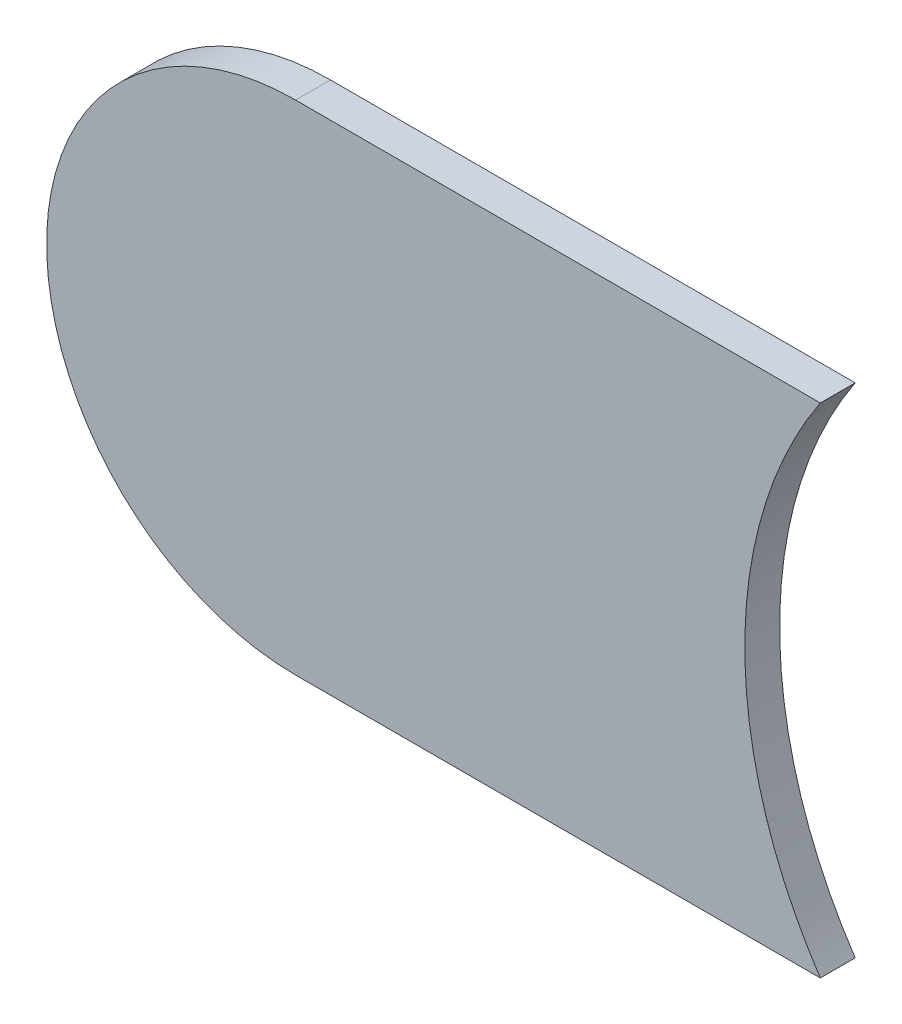
ISO-10303-21;
HEADER;
FILE_DESCRIPTION(('STEP AP214'),'2;1');
FILE_NAME('part.step','',(''),(''),'','','');
FILE_SCHEMA(('AUTOMOTIVE_DESIGN { 1 0 10303 214 1 1 1 1 }'));
ENDSEC;
DATA;
#1=APPLICATION_CONTEXT('core data for automotive mechanical design processes');
#2=APPLICATION_PROTOCOL_DEFINITION('international standard','automotive_design',2000,#1);
#3=PRODUCT_CONTEXT('',#1,'mechanical');
#4=PRODUCT('Part','Part','',(#3));
#5=PRODUCT_RELATED_PRODUCT_CATEGORY('part','',(#4));
#6=PRODUCT_DEFINITION_FORMATION('','',#4);
#7=PRODUCT_DEFINITION_CONTEXT('part definition',#1,'design');
#8=PRODUCT_DEFINITION('design','',#6,#7);
#9=PRODUCT_DEFINITION_SHAPE('','',#8);
#10=(LENGTH_UNIT() NAMED_UNIT(*) SI_UNIT(.MILLI.,.METRE.));
#11=(NAMED_UNIT(*) PLANE_ANGLE_UNIT() SI_UNIT($,.RADIAN.));
#12=(NAMED_UNIT(*) SI_UNIT($,.STERADIAN.) SOLID_ANGLE_UNIT());
#13=UNCERTAINTY_MEASURE_WITH_UNIT(LENGTH_MEASURE(1.E-05),#10,'distance_accuracy_value','');
#14=(GEOMETRIC_REPRESENTATION_CONTEXT(3) GLOBAL_UNCERTAINTY_ASSIGNED_CONTEXT((#13)) GLOBAL_UNIT_ASSIGNED_CONTEXT((#10,
#11,#12)) REPRESENTATION_CONTEXT('',''));
#15=CARTESIAN_POINT('',(0.,0.,0.));
#16=DIRECTION('',(0.,0.,1.));
#17=DIRECTION('',(1.,0.,0.));
#18=AXIS2_PLACEMENT_3D('',#15,#16,#17);
#19=CARTESIAN_POINT('',(177.26,-126.706,-0.035));
#20=DIRECTION('',(0.,-1.,0.));
#21=DIRECTION('',(0.,0.,-1.));
#22=AXIS2_PLACEMENT_3D('',#19,#20,#21);
#23=PLANE('',#22);
#24=DIRECTION('',(0.,0.,1.));
#25=VECTOR('',#24,1.);
#26=CARTESIAN_POINT('',(176.359,-126.706,-0.035));
#27=LINE('',#26,#25);
#28=CARTESIAN_POINT('',(176.359,-126.706,-0.035));
#29=VERTEX_POINT('',#28);
#30=CARTESIAN_POINT('',(176.359,-126.706,0.));
#31=VERTEX_POINT('',#30);
#32=EDGE_CURVE('E11',#29,#31,#27,.T.);
#33=ORIENTED_EDGE('',*,*,#32,.T.);
#34=DIRECTION('',(-1.,0.,0.));
#35=VECTOR('',#34,1.);
#36=CARTESIAN_POINT('',(177.26,-126.706,0.));
#37=LINE('',#36,#35);
#38=CARTESIAN_POINT('',(176.88583426132,-126.706,0.));
#39=VERTEX_POINT('',#38);
#40=EDGE_CURVE('E20',#39,#31,#37,.T.);
#41=ORIENTED_EDGE('',*,*,#40,.F.);
#42=DIRECTION('',(0.,0.,-1.));
#43=VECTOR('',#42,1.);
#44=CARTESIAN_POINT('',(176.88583426132,-126.706,-0.045));
#45=LINE('',#44,#43);
#46=CARTESIAN_POINT('',(176.88583426132,-126.706,-0.035));
#47=VERTEX_POINT('',#46);
#48=EDGE_CURVE('E74',#39,#47,#45,.T.);
#49=ORIENTED_EDGE('',*,*,#48,.T.);
#50=DIRECTION('',(-1.,0.,0.));
#51=VECTOR('',#50,1.);
#52=CARTESIAN_POINT('',(177.26,-126.706,-0.035));
#53=LINE('',#52,#51);
#54=EDGE_CURVE('E104',#47,#29,#53,.T.);
#55=ORIENTED_EDGE('',*,*,#54,.T.);
#56=EDGE_LOOP('',(#33,#41,#49,#55));
#57=FACE_BOUND('',#56,.T.);
#58=ADVANCED_FACE('F17',(#57),#23,.F.);
#59=CARTESIAN_POINT('',(176.359,-126.956,-0.035));
#60=DIRECTION('',(0.,0.,-1.));
#61=DIRECTION('',(0.,1.,0.));
#62=AXIS2_PLACEMENT_3D('',#59,#60,#61);
#63=CYLINDRICAL_SURFACE('',#62,0.25);
#64=CARTESIAN_POINT('',(176.359,-126.956,-0.035));
#65=DIRECTION('',(0.,0.,1.));
#66=DIRECTION('',(0.,1.,0.));
#67=AXIS2_PLACEMENT_3D('',#64,#65,#66);
#68=CIRCLE('',#67,0.25);
#69=CARTESIAN_POINT('',(176.359,-127.206,-0.035));
#70=VERTEX_POINT('',#69);
#71=EDGE_CURVE('E77',#29,#70,#68,.T.);
#72=ORIENTED_EDGE('',*,*,#71,.T.);
#73=DIRECTION('',(0.,0.,1.));
#74=VECTOR('',#73,1.);
#75=CARTESIAN_POINT('',(176.359,-127.206,-0.035));
#76=LINE('',#75,#74);
#77=CARTESIAN_POINT('',(176.359,-127.206,0.));
#78=VERTEX_POINT('',#77);
#79=EDGE_CURVE('E88',#70,#78,#76,.T.);
#80=ORIENTED_EDGE('',*,*,#79,.T.);
#81=CARTESIAN_POINT('',(176.359,-126.956,0.));
#82=DIRECTION('',(0.,0.,1.));
#83=DIRECTION('',(0.,1.,0.));
#84=AXIS2_PLACEMENT_3D('',#81,#82,#83);
#85=CIRCLE('',#84,0.25);
#86=EDGE_CURVE('E83',#31,#78,#85,.T.);
#87=ORIENTED_EDGE('',*,*,#86,.F.);
#88=ORIENTED_EDGE('',*,*,#32,.F.);
#89=EDGE_LOOP('',(#72,#80,#87,#88));
#90=FACE_BOUND('',#89,.T.);
#91=ADVANCED_FACE('F120',(#90),#63,.T.);
#92=CARTESIAN_POINT('',(176.359,-127.206,0.));
#93=DIRECTION('',(0.,0.,1.));
#94=DIRECTION('',(1.,0.,0.));
#95=AXIS2_PLACEMENT_3D('',#92,#93,#94);
#96=PLANE('',#95);
#97=ORIENTED_EDGE('',*,*,#86,.T.);
#98=DIRECTION('',(1.,0.,0.));
#99=VECTOR('',#98,1.);
#100=CARTESIAN_POINT('',(176.359,-127.206,0.));
#101=LINE('',#100,#99);
#102=CARTESIAN_POINT('',(176.88583426132,-127.206,0.));
#103=VERTEX_POINT('',#102);
#104=EDGE_CURVE('E80',#78,#103,#101,.T.);
#105=ORIENTED_EDGE('',*,*,#104,.T.);
#106=CARTESIAN_POINT('',(177.26,-126.956,0.));
#107=DIRECTION('',(0.,0.,-1.));
#108=DIRECTION('',(0.,-1.,0.));
#109=AXIS2_PLACEMENT_3D('',#106,#107,#108);
#110=CIRCLE('',#109,0.45);
#111=EDGE_CURVE('E68',#103,#39,#110,.T.);
#112=ORIENTED_EDGE('',*,*,#111,.T.);
#113=ORIENTED_EDGE('',*,*,#40,.T.);
#114=EDGE_LOOP('',(#97,#105,#112,#113));
#115=FACE_BOUND('',#114,.T.);
#116=ADVANCED_FACE('F81',(#115),#96,.T.);
#117=CARTESIAN_POINT('',(177.26,-126.956,-0.045));
#118=DIRECTION('',(0.,0.,-1.));
#119=DIRECTION('',(0.,-1.,0.));
#120=AXIS2_PLACEMENT_3D('',#117,#118,#119);
#121=CYLINDRICAL_SURFACE('',#120,0.45);
#122=ORIENTED_EDGE('',*,*,#111,.F.);
#123=DIRECTION('',(0.,0.,-1.));
#124=VECTOR('',#123,1.);
#125=CARTESIAN_POINT('',(176.88583426132,-127.206,-0.045));
#126=LINE('',#125,#124);
#127=CARTESIAN_POINT('',(176.88583426132,-127.206,-0.035));
#128=VERTEX_POINT('',#127);
#129=EDGE_CURVE('E73',#103,#128,#126,.T.);
#130=ORIENTED_EDGE('',*,*,#129,.T.);
#131=CARTESIAN_POINT('',(177.26,-126.956,-0.035));
#132=DIRECTION('',(0.,0.,-1.));
#133=DIRECTION('',(0.,-1.,0.));
#134=AXIS2_PLACEMENT_3D('',#131,#132,#133);
#135=CIRCLE('',#134,0.45);
#136=EDGE_CURVE('E106',#128,#47,#135,.T.);
#137=ORIENTED_EDGE('',*,*,#136,.T.);
#138=ORIENTED_EDGE('',*,*,#48,.F.);
#139=EDGE_LOOP('',(#122,#130,#137,#138));
#140=FACE_BOUND('',#139,.T.);
#141=ADVANCED_FACE('F70',(#140),#121,.F.);
#142=CARTESIAN_POINT('',(176.359,-127.206,-0.035));
#143=DIRECTION('',(0.,0.,1.));
#144=DIRECTION('',(1.,0.,0.));
#145=AXIS2_PLACEMENT_3D('',#142,#143,#144);
#146=PLANE('',#145);
#147=ORIENTED_EDGE('',*,*,#54,.F.);
#148=ORIENTED_EDGE('',*,*,#136,.F.);
#149=DIRECTION('',(1.,0.,0.));
#150=VECTOR('',#149,1.);
#151=CARTESIAN_POINT('',(176.359,-127.206,-0.035));
#152=LINE('',#151,#150);
#153=EDGE_CURVE('E93',#70,#128,#152,.T.);
#154=ORIENTED_EDGE('',*,*,#153,.F.);
#155=ORIENTED_EDGE('',*,*,#71,.F.);
#156=EDGE_LOOP('',(#147,#148,#154,#155));
#157=FACE_BOUND('',#156,.T.);
#158=ADVANCED_FACE('F124',(#157),#146,.F.);
#159=CARTESIAN_POINT('',(176.359,-127.206,-0.035));
#160=DIRECTION('',(0.,1.,0.));
#161=DIRECTION('',(1.,0.,0.));
#162=AXIS2_PLACEMENT_3D('',#159,#160,#161);
#163=PLANE('',#162);
#164=ORIENTED_EDGE('',*,*,#129,.F.);
#165=ORIENTED_EDGE('',*,*,#104,.F.);
#166=ORIENTED_EDGE('',*,*,#79,.F.);
#167=ORIENTED_EDGE('',*,*,#153,.T.);
#168=EDGE_LOOP('',(#164,#165,#166,#167));
#169=FACE_BOUND('',#168,.T.);
#170=ADVANCED_FACE('F91',(#169),#163,.F.);
#171=CLOSED_SHELL('',(#58,#91,#116,#141,#158,#170));
#172=MANIFOLD_SOLID_BREP('B1',#171);
#173=ADVANCED_BREP_SHAPE_REPRESENTATION('',(#18,#172),#14);
#174=SHAPE_DEFINITION_REPRESENTATION(#9,#173);
ENDSEC;
END-ISO-10303-21;
